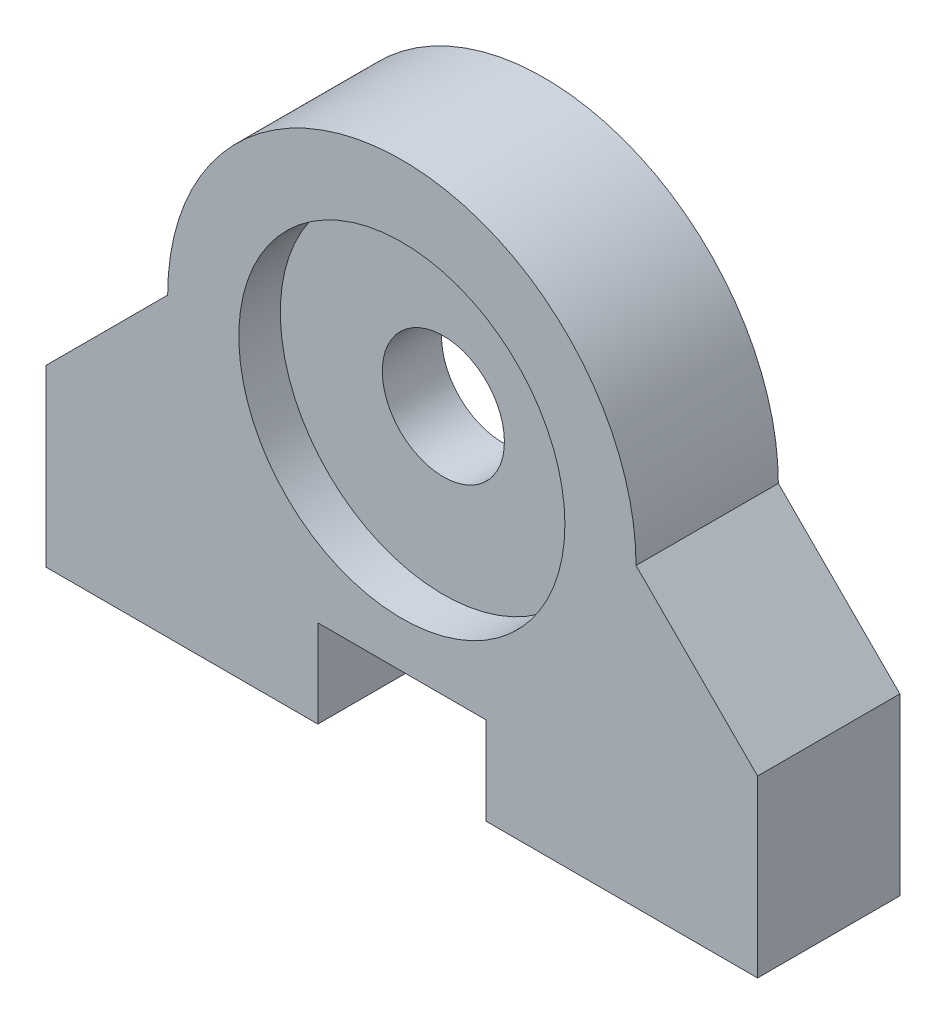
ISO-10303-21;
HEADER;
FILE_DESCRIPTION(('STEP AP214'),'2;1');
FILE_NAME('part.step','',(''),(''),'','','');
FILE_SCHEMA(('AUTOMOTIVE_DESIGN { 1 0 10303 214 1 1 1 1 }'));
ENDSEC;
DATA;
#1=APPLICATION_CONTEXT('core data for automotive mechanical design processes');
#2=APPLICATION_PROTOCOL_DEFINITION('international standard','automotive_design',2000,#1);
#3=PRODUCT_CONTEXT('',#1,'mechanical');
#4=PRODUCT('Part','Part','',(#3));
#5=PRODUCT_RELATED_PRODUCT_CATEGORY('part','',(#4));
#6=PRODUCT_DEFINITION_FORMATION('','',#4);
#7=PRODUCT_DEFINITION_CONTEXT('part definition',#1,'design');
#8=PRODUCT_DEFINITION('design','',#6,#7);
#9=PRODUCT_DEFINITION_SHAPE('','',#8);
#10=(LENGTH_UNIT() NAMED_UNIT(*) SI_UNIT(.MILLI.,.METRE.));
#11=(NAMED_UNIT(*) PLANE_ANGLE_UNIT() SI_UNIT($,.RADIAN.));
#12=(NAMED_UNIT(*) SI_UNIT($,.STERADIAN.) SOLID_ANGLE_UNIT());
#13=UNCERTAINTY_MEASURE_WITH_UNIT(LENGTH_MEASURE(1.E-05),#10,'distance_accuracy_value','');
#14=(GEOMETRIC_REPRESENTATION_CONTEXT(3) GLOBAL_UNCERTAINTY_ASSIGNED_CONTEXT((#13)) GLOBAL_UNIT_ASSIGNED_CONTEXT((#10,
#11,#12)) REPRESENTATION_CONTEXT('',''));
#15=CARTESIAN_POINT('',(0.,0.,0.));
#16=DIRECTION('',(0.,0.,1.));
#17=DIRECTION('',(1.,0.,0.));
#18=AXIS2_PLACEMENT_3D('',#15,#16,#17);
#19=CARTESIAN_POINT('',(0.,15.875,7.62));
#20=DIRECTION('',(0.,0.,-1.));
#21=DIRECTION('',(-1.,0.,0.));
#22=AXIS2_PLACEMENT_3D('',#19,#20,#21);
#23=CYLINDRICAL_SURFACE('',#22,8.73125);
#24=CARTESIAN_POINT('',(0.,15.875,0.));
#25=DIRECTION('',(0.,0.,1.));
#26=DIRECTION('',(1.,0.,0.));
#27=AXIS2_PLACEMENT_3D('',#24,#25,#26);
#28=CIRCLE('',#27,8.73125);
#29=CARTESIAN_POINT('',(8.73125,15.875,0.));
#30=VERTEX_POINT('',#29);
#31=EDGE_CURVE('E259',#30,#30,#28,.T.);
#32=ORIENTED_EDGE('',*,*,#31,.F.);
#33=EDGE_LOOP('',(#32));
#34=FACE_BOUND('',#33,.T.);
#35=CARTESIAN_POINT('',(0.,15.875,2.2225));
#36=DIRECTION('',(0.,0.,1.));
#37=DIRECTION('',(1.,0.,0.));
#38=AXIS2_PLACEMENT_3D('',#35,#36,#37);
#39=CIRCLE('',#38,8.73125);
#40=CARTESIAN_POINT('',(8.73125,15.875,2.2225));
#41=VERTEX_POINT('',#40);
#42=EDGE_CURVE('E37',#41,#41,#39,.T.);
#43=ORIENTED_EDGE('',*,*,#42,.T.);
#44=EDGE_LOOP('',(#43));
#45=FACE_BOUND('',#44,.T.);
#46=ADVANCED_FACE('F33',(#34,#45),#23,.F.);
#47=CARTESIAN_POINT('',(0.,15.875,7.62));
#48=DIRECTION('',(0.,0.,-1.));
#49=DIRECTION('',(-1.,0.,0.));
#50=AXIS2_PLACEMENT_3D('',#47,#48,#49);
#51=PLANE('',#50);
#52=DIRECTION('',(0.,1.,0.));
#53=VECTOR('',#52,1.);
#54=CARTESIAN_POINT('',(-4.5,4.699,7.62));
#55=LINE('',#54,#53);
#56=CARTESIAN_POINT('',(-4.5,0.,7.62));
#57=VERTEX_POINT('',#56);
#58=CARTESIAN_POINT('',(-4.5,4.699,7.62));
#59=VERTEX_POINT('',#58);
#60=EDGE_CURVE('E164',#57,#59,#55,.T.);
#61=ORIENTED_EDGE('',*,*,#60,.T.);
#62=DIRECTION('',(1.,0.,0.));
#63=VECTOR('',#62,1.);
#64=CARTESIAN_POINT('',(4.5,4.699,7.62));
#65=LINE('',#64,#63);
#66=CARTESIAN_POINT('',(4.5,4.699,7.62));
#67=VERTEX_POINT('',#66);
#68=EDGE_CURVE('E101',#59,#67,#65,.T.);
#69=ORIENTED_EDGE('',*,*,#68,.T.);
#70=DIRECTION('',(0.,-1.,0.));
#71=VECTOR('',#70,1.);
#72=CARTESIAN_POINT('',(4.5,4.699,7.62));
#73=LINE('',#72,#71);
#74=CARTESIAN_POINT('',(4.5,0.,7.62));
#75=VERTEX_POINT('',#74);
#76=EDGE_CURVE('E205',#67,#75,#73,.T.);
#77=ORIENTED_EDGE('',*,*,#76,.T.);
#78=DIRECTION('',(1.,0.,0.));
#79=VECTOR('',#78,1.);
#80=CARTESIAN_POINT('',(4.5,0.,7.62));
#81=LINE('',#80,#79);
#82=CARTESIAN_POINT('',(19.05,0.,7.62));
#83=VERTEX_POINT('',#82);
#84=EDGE_CURVE('E202',#75,#83,#81,.T.);
#85=ORIENTED_EDGE('',*,*,#84,.T.);
#86=DIRECTION('',(0.,1.,0.));
#87=VECTOR('',#86,1.);
#88=CARTESIAN_POINT('',(19.05,0.,7.62));
#89=LINE('',#88,#87);
#90=CARTESIAN_POINT('',(19.05,9.36625000000002,7.62));
#91=VERTEX_POINT('',#90);
#92=EDGE_CURVE('E204',#83,#91,#89,.T.);
#93=ORIENTED_EDGE('',*,*,#92,.T.);
#94=DIRECTION('',(-0.707106781186549,0.707106781186546,0.));
#95=VECTOR('',#94,1.);
#96=CARTESIAN_POINT('',(19.05,9.36625000000002,7.62));
#97=LINE('',#96,#95);
#98=CARTESIAN_POINT('',(12.54125,15.875,7.62));
#99=VERTEX_POINT('',#98);
#100=EDGE_CURVE('E207',#91,#99,#97,.T.);
#101=ORIENTED_EDGE('',*,*,#100,.T.);
#102=CARTESIAN_POINT('',(0.,15.875,7.62));
#103=DIRECTION('',(0.,0.,1.));
#104=DIRECTION('',(-1.,0.,0.));
#105=AXIS2_PLACEMENT_3D('',#102,#103,#104);
#106=CIRCLE('',#105,12.54125);
#107=CARTESIAN_POINT('',(-12.54125,15.875,7.62));
#108=VERTEX_POINT('',#107);
#109=EDGE_CURVE('E127',#99,#108,#106,.T.);
#110=ORIENTED_EDGE('',*,*,#109,.T.);
#111=DIRECTION('',(-0.707106781186549,-0.707106781186546,0.));
#112=VECTOR('',#111,1.);
#113=CARTESIAN_POINT('',(-19.05,9.36625000000002,7.62));
#114=LINE('',#113,#112);
#115=CARTESIAN_POINT('',(-19.05,9.36625000000002,7.62));
#116=VERTEX_POINT('',#115);
#117=EDGE_CURVE('E120',#108,#116,#114,.T.);
#118=ORIENTED_EDGE('',*,*,#117,.T.);
#119=DIRECTION('',(0.,-1.,0.));
#120=VECTOR('',#119,1.);
#121=CARTESIAN_POINT('',(-19.05,0.,7.62));
#122=LINE('',#121,#120);
#123=CARTESIAN_POINT('',(-19.05,0.,7.62));
#124=VERTEX_POINT('',#123);
#125=EDGE_CURVE('E125',#116,#124,#122,.T.);
#126=ORIENTED_EDGE('',*,*,#125,.T.);
#127=DIRECTION('',(1.,0.,0.));
#128=VECTOR('',#127,1.);
#129=CARTESIAN_POINT('',(-4.5,0.,7.62));
#130=LINE('',#129,#128);
#131=EDGE_CURVE('E51',#124,#57,#130,.T.);
#132=ORIENTED_EDGE('',*,*,#131,.T.);
#133=EDGE_LOOP('',(#61,#69,#77,#85,#93,#101,#110,#118,#126,#132));
#134=FACE_BOUND('',#133,.T.);
#135=CARTESIAN_POINT('',(0.,15.875,7.62));
#136=DIRECTION('',(0.,0.,1.));
#137=DIRECTION('',(1.,0.,0.));
#138=AXIS2_PLACEMENT_3D('',#135,#136,#137);
#139=CIRCLE('',#138,8.73125);
#140=CARTESIAN_POINT('',(8.73125,15.875,7.62));
#141=VERTEX_POINT('',#140);
#142=EDGE_CURVE('E149',#141,#141,#139,.T.);
#143=ORIENTED_EDGE('',*,*,#142,.F.);
#144=EDGE_LOOP('',(#143));
#145=FACE_BOUND('',#144,.T.);
#146=ADVANCED_FACE('F122',(#134,#145),#51,.F.);
#147=CARTESIAN_POINT('',(0.,15.875,0.));
#148=DIRECTION('',(0.,0.,-1.));
#149=DIRECTION('',(-1.,0.,0.));
#150=AXIS2_PLACEMENT_3D('',#147,#148,#149);
#151=PLANE('',#150);
#152=DIRECTION('',(0.,1.,0.));
#153=VECTOR('',#152,1.);
#154=CARTESIAN_POINT('',(-4.5,4.699,0.));
#155=LINE('',#154,#153);
#156=CARTESIAN_POINT('',(-4.5,0.,0.));
#157=VERTEX_POINT('',#156);
#158=CARTESIAN_POINT('',(-4.5,4.699,0.));
#159=VERTEX_POINT('',#158);
#160=EDGE_CURVE('E145',#157,#159,#155,.T.);
#161=ORIENTED_EDGE('',*,*,#160,.F.);
#162=DIRECTION('',(1.,0.,0.));
#163=VECTOR('',#162,1.);
#164=CARTESIAN_POINT('',(-4.5,0.,0.));
#165=LINE('',#164,#163);
#166=CARTESIAN_POINT('',(-19.05,0.,0.));
#167=VERTEX_POINT('',#166);
#168=EDGE_CURVE('E92',#167,#157,#165,.T.);
#169=ORIENTED_EDGE('',*,*,#168,.F.);
#170=DIRECTION('',(0.,-1.,0.));
#171=VECTOR('',#170,1.);
#172=CARTESIAN_POINT('',(-19.05,0.,0.));
#173=LINE('',#172,#171);
#174=CARTESIAN_POINT('',(-19.05,9.36625000000002,0.));
#175=VERTEX_POINT('',#174);
#176=EDGE_CURVE('E86',#175,#167,#173,.T.);
#177=ORIENTED_EDGE('',*,*,#176,.F.);
#178=DIRECTION('',(-0.707106781186549,-0.707106781186546,0.));
#179=VECTOR('',#178,1.);
#180=CARTESIAN_POINT('',(-19.05,9.36625000000002,0.));
#181=LINE('',#180,#179);
#182=CARTESIAN_POINT('',(-12.54125,15.875,0.));
#183=VERTEX_POINT('',#182);
#184=EDGE_CURVE('E135',#183,#175,#181,.T.);
#185=ORIENTED_EDGE('',*,*,#184,.F.);
#186=CARTESIAN_POINT('',(0.,15.875,0.));
#187=DIRECTION('',(0.,0.,1.));
#188=DIRECTION('',(-1.,0.,0.));
#189=AXIS2_PLACEMENT_3D('',#186,#187,#188);
#190=CIRCLE('',#189,12.54125);
#191=CARTESIAN_POINT('',(12.54125,15.875,0.));
#192=VERTEX_POINT('',#191);
#193=EDGE_CURVE('E159',#192,#183,#190,.T.);
#194=ORIENTED_EDGE('',*,*,#193,.F.);
#195=DIRECTION('',(-0.707106781186549,0.707106781186546,0.));
#196=VECTOR('',#195,1.);
#197=CARTESIAN_POINT('',(19.05,9.36625000000002,0.));
#198=LINE('',#197,#196);
#199=CARTESIAN_POINT('',(19.05,9.36625000000002,0.));
#200=VERTEX_POINT('',#199);
#201=EDGE_CURVE('E157',#200,#192,#198,.T.);
#202=ORIENTED_EDGE('',*,*,#201,.F.);
#203=DIRECTION('',(0.,1.,0.));
#204=VECTOR('',#203,1.);
#205=CARTESIAN_POINT('',(19.05,0.,0.));
#206=LINE('',#205,#204);
#207=CARTESIAN_POINT('',(19.05,0.,0.));
#208=VERTEX_POINT('',#207);
#209=EDGE_CURVE('E155',#208,#200,#206,.T.);
#210=ORIENTED_EDGE('',*,*,#209,.F.);
#211=DIRECTION('',(1.,0.,0.));
#212=VECTOR('',#211,1.);
#213=CARTESIAN_POINT('',(4.5,0.,0.));
#214=LINE('',#213,#212);
#215=CARTESIAN_POINT('',(4.5,0.,0.));
#216=VERTEX_POINT('',#215);
#217=EDGE_CURVE('E153',#216,#208,#214,.T.);
#218=ORIENTED_EDGE('',*,*,#217,.F.);
#219=DIRECTION('',(0.,-1.,0.));
#220=VECTOR('',#219,1.);
#221=CARTESIAN_POINT('',(4.5,4.699,0.));
#222=LINE('',#221,#220);
#223=CARTESIAN_POINT('',(4.5,4.699,0.));
#224=VERTEX_POINT('',#223);
#225=EDGE_CURVE('E151',#224,#216,#222,.T.);
#226=ORIENTED_EDGE('',*,*,#225,.F.);
#227=DIRECTION('',(1.,0.,0.));
#228=VECTOR('',#227,1.);
#229=CARTESIAN_POINT('',(4.5,4.699,0.));
#230=LINE('',#229,#228);
#231=EDGE_CURVE('E148',#159,#224,#230,.T.);
#232=ORIENTED_EDGE('',*,*,#231,.F.);
#233=EDGE_LOOP('',(#161,#169,#177,#185,#194,#202,#210,#218,#226,#232));
#234=FACE_BOUND('',#233,.T.);
#235=ORIENTED_EDGE('',*,*,#31,.T.);
#236=EDGE_LOOP('',(#235));
#237=FACE_BOUND('',#236,.T.);
#238=ADVANCED_FACE('F189',(#234,#237),#151,.T.);
#239=CARTESIAN_POINT('',(-4.5,4.699,7.62));
#240=DIRECTION('',(-1.,0.,0.));
#241=DIRECTION('',(0.,0.,1.));
#242=AXIS2_PLACEMENT_3D('',#239,#240,#241);
#243=PLANE('',#242);
#244=ORIENTED_EDGE('',*,*,#160,.T.);
#245=DIRECTION('',(0.,0.,-1.));
#246=VECTOR('',#245,1.);
#247=CARTESIAN_POINT('',(-4.5,4.699,7.62));
#248=LINE('',#247,#246);
#249=EDGE_CURVE('E43',#59,#159,#248,.T.);
#250=ORIENTED_EDGE('',*,*,#249,.F.);
#251=ORIENTED_EDGE('',*,*,#60,.F.);
#252=DIRECTION('',(0.,0.,-1.));
#253=VECTOR('',#252,1.);
#254=CARTESIAN_POINT('',(-4.5,0.,7.62));
#255=LINE('',#254,#253);
#256=EDGE_CURVE('E141',#57,#157,#255,.T.);
#257=ORIENTED_EDGE('',*,*,#256,.T.);
#258=EDGE_LOOP('',(#244,#250,#251,#257));
#259=FACE_BOUND('',#258,.T.);
#260=ADVANCED_FACE('F35',(#259),#243,.F.);
#261=CARTESIAN_POINT('',(4.5,4.699,7.62));
#262=DIRECTION('',(0.,1.,0.));
#263=DIRECTION('',(0.,0.,1.));
#264=AXIS2_PLACEMENT_3D('',#261,#262,#263);
#265=PLANE('',#264);
#266=ORIENTED_EDGE('',*,*,#231,.T.);
#267=DIRECTION('',(0.,0.,-1.));
#268=VECTOR('',#267,1.);
#269=CARTESIAN_POINT('',(4.5,4.699,7.62));
#270=LINE('',#269,#268);
#271=EDGE_CURVE('E180',#67,#224,#270,.T.);
#272=ORIENTED_EDGE('',*,*,#271,.F.);
#273=ORIENTED_EDGE('',*,*,#68,.F.);
#274=ORIENTED_EDGE('',*,*,#249,.T.);
#275=EDGE_LOOP('',(#266,#272,#273,#274));
#276=FACE_BOUND('',#275,.T.);
#277=ADVANCED_FACE('F184',(#276),#265,.F.);
#278=CARTESIAN_POINT('',(4.5,4.699,7.62));
#279=DIRECTION('',(1.,0.,0.));
#280=DIRECTION('',(0.,0.,-1.));
#281=AXIS2_PLACEMENT_3D('',#278,#279,#280);
#282=PLANE('',#281);
#283=ORIENTED_EDGE('',*,*,#225,.T.);
#284=DIRECTION('',(0.,0.,-1.));
#285=VECTOR('',#284,1.);
#286=CARTESIAN_POINT('',(4.5,0.,7.62));
#287=LINE('',#286,#285);
#288=EDGE_CURVE('E177',#75,#216,#287,.T.);
#289=ORIENTED_EDGE('',*,*,#288,.F.);
#290=ORIENTED_EDGE('',*,*,#76,.F.);
#291=ORIENTED_EDGE('',*,*,#271,.T.);
#292=EDGE_LOOP('',(#283,#289,#290,#291));
#293=FACE_BOUND('',#292,.T.);
#294=ADVANCED_FACE('F196',(#293),#282,.F.);
#295=CARTESIAN_POINT('',(4.5,0.,7.62));
#296=DIRECTION('',(0.,1.,0.));
#297=DIRECTION('',(-1.,0.,0.));
#298=AXIS2_PLACEMENT_3D('',#295,#296,#297);
#299=PLANE('',#298);
#300=CARTESIAN_POINT('',(11.43,0.,3.81));
#301=DIRECTION('',(0.,-1.,0.));
#302=DIRECTION('',(1.,0.,0.));
#303=AXIS2_PLACEMENT_3D('',#300,#301,#302);
#304=CIRCLE('',#303,1.98374);
#305=CARTESIAN_POINT('',(13.41374,0.,3.81));
#306=VERTEX_POINT('',#305);
#307=EDGE_CURVE('E272',#306,#306,#304,.T.);
#308=ORIENTED_EDGE('',*,*,#307,.F.);
#309=EDGE_LOOP('',(#308));
#310=FACE_BOUND('',#309,.T.);
#311=ORIENTED_EDGE('',*,*,#217,.T.);
#312=DIRECTION('',(0.,0.,-1.));
#313=VECTOR('',#312,1.);
#314=CARTESIAN_POINT('',(19.05,0.,7.62));
#315=LINE('',#314,#313);
#316=EDGE_CURVE('E174',#83,#208,#315,.T.);
#317=ORIENTED_EDGE('',*,*,#316,.F.);
#318=ORIENTED_EDGE('',*,*,#84,.F.);
#319=ORIENTED_EDGE('',*,*,#288,.T.);
#320=EDGE_LOOP('',(#311,#317,#318,#319));
#321=FACE_BOUND('',#320,.T.);
#322=ADVANCED_FACE('F200',(#310,#321),#299,.F.);
#323=CARTESIAN_POINT('',(19.05,0.,7.62));
#324=DIRECTION('',(-1.,0.,0.));
#325=DIRECTION('',(0.,-1.,0.));
#326=AXIS2_PLACEMENT_3D('',#323,#324,#325);
#327=PLANE('',#326);
#328=ORIENTED_EDGE('',*,*,#209,.T.);
#329=DIRECTION('',(0.,0.,-1.));
#330=VECTOR('',#329,1.);
#331=CARTESIAN_POINT('',(19.05,9.36625000000002,7.62));
#332=LINE('',#331,#330);
#333=EDGE_CURVE('E171',#91,#200,#332,.T.);
#334=ORIENTED_EDGE('',*,*,#333,.F.);
#335=ORIENTED_EDGE('',*,*,#92,.F.);
#336=ORIENTED_EDGE('',*,*,#316,.T.);
#337=EDGE_LOOP('',(#328,#334,#335,#336));
#338=FACE_BOUND('',#337,.T.);
#339=ADVANCED_FACE('F222',(#338),#327,.F.);
#340=CARTESIAN_POINT('',(19.05,9.36625000000002,7.62));
#341=DIRECTION('',(-0.707106781186546,-0.707106781186549,0.));
#342=DIRECTION('',(0.707106781186549,-0.707106781186546,0.));
#343=AXIS2_PLACEMENT_3D('',#340,#341,#342);
#344=PLANE('',#343);
#345=ORIENTED_EDGE('',*,*,#201,.T.);
#346=DIRECTION('',(0.,0.,-1.));
#347=VECTOR('',#346,1.);
#348=CARTESIAN_POINT('',(12.54125,15.875,7.62));
#349=LINE('',#348,#347);
#350=EDGE_CURVE('E168',#99,#192,#349,.T.);
#351=ORIENTED_EDGE('',*,*,#350,.F.);
#352=ORIENTED_EDGE('',*,*,#100,.F.);
#353=ORIENTED_EDGE('',*,*,#333,.T.);
#354=EDGE_LOOP('',(#345,#351,#352,#353));
#355=FACE_BOUND('',#354,.T.);
#356=ADVANCED_FACE('F216',(#355),#344,.F.);
#357=CARTESIAN_POINT('',(0.,15.875,7.62));
#358=DIRECTION('',(0.,0.,-1.));
#359=DIRECTION('',(-1.,0.,0.));
#360=AXIS2_PLACEMENT_3D('',#357,#358,#359);
#361=CYLINDRICAL_SURFACE('',#360,12.54125);
#362=ORIENTED_EDGE('',*,*,#193,.T.);
#363=DIRECTION('',(0.,0.,-1.));
#364=VECTOR('',#363,1.);
#365=CARTESIAN_POINT('',(-12.54125,15.875,7.62));
#366=LINE('',#365,#364);
#367=EDGE_CURVE('E136',#108,#183,#366,.T.);
#368=ORIENTED_EDGE('',*,*,#367,.F.);
#369=ORIENTED_EDGE('',*,*,#109,.F.);
#370=ORIENTED_EDGE('',*,*,#350,.T.);
#371=EDGE_LOOP('',(#362,#368,#369,#370));
#372=FACE_BOUND('',#371,.T.);
#373=ADVANCED_FACE('F220',(#372),#361,.T.);
#374=CARTESIAN_POINT('',(-19.05,9.36625000000002,7.62));
#375=DIRECTION('',(0.707106781186546,-0.707106781186549,0.));
#376=DIRECTION('',(0.707106781186549,0.707106781186546,0.));
#377=AXIS2_PLACEMENT_3D('',#374,#375,#376);
#378=PLANE('',#377);
#379=ORIENTED_EDGE('',*,*,#184,.T.);
#380=DIRECTION('',(0.,0.,-1.));
#381=VECTOR('',#380,1.);
#382=CARTESIAN_POINT('',(-19.05,9.36625000000002,7.62));
#383=LINE('',#382,#381);
#384=EDGE_CURVE('E132',#116,#175,#383,.T.);
#385=ORIENTED_EDGE('',*,*,#384,.F.);
#386=ORIENTED_EDGE('',*,*,#117,.F.);
#387=ORIENTED_EDGE('',*,*,#367,.T.);
#388=EDGE_LOOP('',(#379,#385,#386,#387));
#389=FACE_BOUND('',#388,.T.);
#390=ADVANCED_FACE('F133',(#389),#378,.F.);
#391=CARTESIAN_POINT('',(-19.05,0.,7.62));
#392=DIRECTION('',(1.,0.,0.));
#393=DIRECTION('',(0.,1.,0.));
#394=AXIS2_PLACEMENT_3D('',#391,#392,#393);
#395=PLANE('',#394);
#396=ORIENTED_EDGE('',*,*,#176,.T.);
#397=DIRECTION('',(0.,0.,-1.));
#398=VECTOR('',#397,1.);
#399=CARTESIAN_POINT('',(-19.05,0.,7.62));
#400=LINE('',#399,#398);
#401=EDGE_CURVE('E137',#124,#167,#400,.T.);
#402=ORIENTED_EDGE('',*,*,#401,.F.);
#403=ORIENTED_EDGE('',*,*,#125,.F.);
#404=ORIENTED_EDGE('',*,*,#384,.T.);
#405=EDGE_LOOP('',(#396,#402,#403,#404));
#406=FACE_BOUND('',#405,.T.);
#407=ADVANCED_FACE('F139',(#406),#395,.F.);
#408=CARTESIAN_POINT('',(-4.5,0.,7.62));
#409=DIRECTION('',(0.,1.,0.));
#410=DIRECTION('',(-1.,0.,0.));
#411=AXIS2_PLACEMENT_3D('',#408,#409,#410);
#412=PLANE('',#411);
#413=CARTESIAN_POINT('',(-11.43,0.,3.81));
#414=DIRECTION('',(0.,-1.,0.));
#415=DIRECTION('',(-1.,0.,0.));
#416=AXIS2_PLACEMENT_3D('',#413,#414,#415);
#417=CIRCLE('',#416,1.98374);
#418=CARTESIAN_POINT('',(-13.41374,0.,3.81));
#419=VERTEX_POINT('',#418);
#420=EDGE_CURVE('E278',#419,#419,#417,.T.);
#421=ORIENTED_EDGE('',*,*,#420,.F.);
#422=EDGE_LOOP('',(#421));
#423=FACE_BOUND('',#422,.T.);
#424=ORIENTED_EDGE('',*,*,#168,.T.);
#425=ORIENTED_EDGE('',*,*,#256,.F.);
#426=ORIENTED_EDGE('',*,*,#131,.F.);
#427=ORIENTED_EDGE('',*,*,#401,.T.);
#428=EDGE_LOOP('',(#424,#425,#426,#427));
#429=FACE_BOUND('',#428,.T.);
#430=ADVANCED_FACE('F245',(#423,#429),#412,.F.);
#431=CARTESIAN_POINT('',(0.,15.875,5.3975));
#432=DIRECTION('',(0.,0.,1.));
#433=DIRECTION('',(1.,0.,0.));
#434=AXIS2_PLACEMENT_3D('',#431,#432,#433);
#435=CIRCLE('',#434,8.73125);
#436=CARTESIAN_POINT('',(8.73125,15.875,5.3975));
#437=VERTEX_POINT('',#436);
#438=EDGE_CURVE('E11',#437,#437,#435,.T.);
#439=ORIENTED_EDGE('',*,*,#438,.F.);
#440=EDGE_LOOP('',(#439));
#441=FACE_BOUND('',#440,.T.);
#442=ORIENTED_EDGE('',*,*,#142,.T.);
#443=EDGE_LOOP('',(#442));
#444=FACE_BOUND('',#443,.T.);
#445=ADVANCED_FACE('F235',(#441,#444),#23,.F.);
#446=CARTESIAN_POINT('',(0.,15.875,2.2225));
#447=DIRECTION('',(0.,0.,1.));
#448=DIRECTION('',(1.,0.,0.));
#449=AXIS2_PLACEMENT_3D('',#446,#447,#448);
#450=PLANE('',#449);
#451=ORIENTED_EDGE('',*,*,#42,.F.);
#452=EDGE_LOOP('',(#451));
#453=FACE_BOUND('',#452,.T.);
#454=CARTESIAN_POINT('',(0.,15.875,2.2225));
#455=DIRECTION('',(0.,0.,1.));
#456=DIRECTION('',(1.,0.,0.));
#457=AXIS2_PLACEMENT_3D('',#454,#455,#456);
#458=CIRCLE('',#457,3.27025);
#459=CARTESIAN_POINT('',(3.27025,15.875,2.2225));
#460=VERTEX_POINT('',#459);
#461=EDGE_CURVE('E264',#460,#460,#458,.T.);
#462=ORIENTED_EDGE('',*,*,#461,.T.);
#463=EDGE_LOOP('',(#462));
#464=FACE_BOUND('',#463,.T.);
#465=ADVANCED_FACE('F244',(#453,#464),#450,.F.);
#466=CARTESIAN_POINT('',(0.,15.875,2.2225));
#467=DIRECTION('',(0.,0.,1.));
#468=DIRECTION('',(1.,0.,0.));
#469=AXIS2_PLACEMENT_3D('',#466,#467,#468);
#470=CYLINDRICAL_SURFACE('',#469,3.27025);
#471=ORIENTED_EDGE('',*,*,#461,.F.);
#472=EDGE_LOOP('',(#471));
#473=FACE_BOUND('',#472,.T.);
#474=CARTESIAN_POINT('',(0.,15.875,5.3975));
#475=DIRECTION('',(0.,0.,1.));
#476=DIRECTION('',(1.,0.,0.));
#477=AXIS2_PLACEMENT_3D('',#474,#475,#476);
#478=CIRCLE('',#477,3.27025);
#479=CARTESIAN_POINT('',(3.27025,15.875,5.3975));
#480=VERTEX_POINT('',#479);
#481=EDGE_CURVE('E268',#480,#480,#478,.T.);
#482=ORIENTED_EDGE('',*,*,#481,.T.);
#483=EDGE_LOOP('',(#482));
#484=FACE_BOUND('',#483,.T.);
#485=ADVANCED_FACE('F251',(#473,#484),#470,.F.);
#486=CARTESIAN_POINT('',(0.,15.875,5.3975));
#487=DIRECTION('',(0.,0.,1.));
#488=DIRECTION('',(1.,0.,0.));
#489=AXIS2_PLACEMENT_3D('',#486,#487,#488);
#490=PLANE('',#489);
#491=ORIENTED_EDGE('',*,*,#438,.T.);
#492=EDGE_LOOP('',(#491));
#493=FACE_BOUND('',#492,.T.);
#494=ORIENTED_EDGE('',*,*,#481,.F.);
#495=EDGE_LOOP('',(#494));
#496=FACE_BOUND('',#495,.T.);
#497=ADVANCED_FACE('F303',(#493,#496),#490,.T.);
#498=CARTESIAN_POINT('',(11.43,10.16,3.81));
#499=DIRECTION('',(0.,-1.,0.));
#500=DIRECTION('',(1.,0.,0.));
#501=AXIS2_PLACEMENT_3D('',#498,#499,#500);
#502=CYLINDRICAL_SURFACE('',#501,1.98374);
#503=CARTESIAN_POINT('',(11.43,10.16,3.81));
#504=DIRECTION('',(0.,-1.,0.));
#505=DIRECTION('',(1.,0.,0.));
#506=AXIS2_PLACEMENT_3D('',#503,#504,#505);
#507=CIRCLE('',#506,1.98374);
#508=CARTESIAN_POINT('',(13.41374,10.16,3.81));
#509=VERTEX_POINT('',#508);
#510=EDGE_CURVE('E271',#509,#509,#507,.T.);
#511=ORIENTED_EDGE('',*,*,#510,.F.);
#512=EDGE_LOOP('',(#511));
#513=FACE_BOUND('',#512,.T.);
#514=ORIENTED_EDGE('',*,*,#307,.T.);
#515=EDGE_LOOP('',(#514));
#516=FACE_BOUND('',#515,.T.);
#517=ADVANCED_FACE('F297',(#513,#516),#502,.F.);
#518=CARTESIAN_POINT('',(11.43,10.16,3.81));
#519=DIRECTION('',(0.,-1.,0.));
#520=DIRECTION('',(1.,0.,0.));
#521=AXIS2_PLACEMENT_3D('',#518,#519,#520);
#522=PLANE('',#521);
#523=ORIENTED_EDGE('',*,*,#510,.T.);
#524=EDGE_LOOP('',(#523));
#525=FACE_BOUND('',#524,.T.);
#526=ADVANCED_FACE('F289',(#525),#522,.T.);
#527=CARTESIAN_POINT('',(-11.43,10.16,3.81));
#528=DIRECTION('',(0.,-1.,0.));
#529=DIRECTION('',(1.,0.,0.));
#530=AXIS2_PLACEMENT_3D('',#527,#528,#529);
#531=CYLINDRICAL_SURFACE('',#530,1.98374);
#532=CARTESIAN_POINT('',(-11.43,10.16,3.81));
#533=DIRECTION('',(0.,-1.,0.));
#534=DIRECTION('',(-1.,0.,0.));
#535=AXIS2_PLACEMENT_3D('',#532,#533,#534);
#536=CIRCLE('',#535,1.98374);
#537=CARTESIAN_POINT('',(-13.41374,10.16,3.81));
#538=VERTEX_POINT('',#537);
#539=EDGE_CURVE('E275',#538,#538,#536,.T.);
#540=ORIENTED_EDGE('',*,*,#539,.F.);
#541=EDGE_LOOP('',(#540));
#542=FACE_BOUND('',#541,.T.);
#543=ORIENTED_EDGE('',*,*,#420,.T.);
#544=EDGE_LOOP('',(#543));
#545=FACE_BOUND('',#544,.T.);
#546=ADVANCED_FACE('F286',(#542,#545),#531,.F.);
#547=CARTESIAN_POINT('',(-11.43,10.16,3.81));
#548=DIRECTION('',(0.,1.,0.));
#549=DIRECTION('',(-1.,0.,0.));
#550=AXIS2_PLACEMENT_3D('',#547,#548,#549);
#551=PLANE('',#550);
#552=ORIENTED_EDGE('',*,*,#539,.T.);
#553=EDGE_LOOP('',(#552));
#554=FACE_BOUND('',#553,.T.);
#555=ADVANCED_FACE('F284',(#554),#551,.F.);
#556=CLOSED_SHELL('',(#46,#146,#238,#260,#277,#294,#322,#339,#356,#373,#390,#407,#430,#445,#465,
#485,#497,#517,#526,#546,#555));
#557=MANIFOLD_SOLID_BREP('B2',#556);
#558=ADVANCED_BREP_SHAPE_REPRESENTATION('',(#18,#557),#14);
#559=SHAPE_DEFINITION_REPRESENTATION(#9,#558);
ENDSEC;
END-ISO-10303-21;
